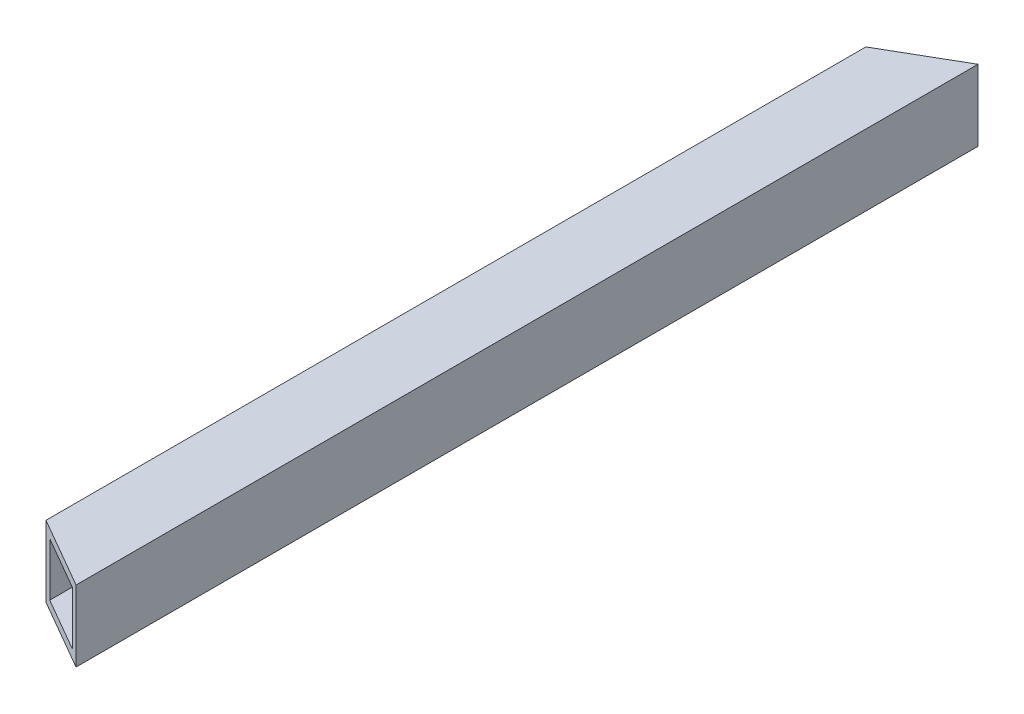
ISO-10303-21;
HEADER;
FILE_DESCRIPTION(('STEP AP214'),'2;1');
FILE_NAME('part.step','',(''),(''),'','','');
FILE_SCHEMA(('AUTOMOTIVE_DESIGN { 1 0 10303 214 1 1 1 1 }'));
ENDSEC;
DATA;
#1=APPLICATION_CONTEXT('core data for automotive mechanical design processes');
#2=APPLICATION_PROTOCOL_DEFINITION('international standard','automotive_design',2000,#1);
#3=PRODUCT_CONTEXT('',#1,'mechanical');
#4=PRODUCT('Part','Part','',(#3));
#5=PRODUCT_RELATED_PRODUCT_CATEGORY('part','',(#4));
#6=PRODUCT_DEFINITION_FORMATION('','',#4);
#7=PRODUCT_DEFINITION_CONTEXT('part definition',#1,'design');
#8=PRODUCT_DEFINITION('design','',#6,#7);
#9=PRODUCT_DEFINITION_SHAPE('','',#8);
#10=(LENGTH_UNIT() NAMED_UNIT(*) SI_UNIT(.MILLI.,.METRE.));
#11=(NAMED_UNIT(*) PLANE_ANGLE_UNIT() SI_UNIT($,.RADIAN.));
#12=(NAMED_UNIT(*) SI_UNIT($,.STERADIAN.) SOLID_ANGLE_UNIT());
#13=UNCERTAINTY_MEASURE_WITH_UNIT(LENGTH_MEASURE(1.E-05),#10,'distance_accuracy_value','');
#14=(GEOMETRIC_REPRESENTATION_CONTEXT(3) GLOBAL_UNCERTAINTY_ASSIGNED_CONTEXT((#13)) GLOBAL_UNIT_ASSIGNED_CONTEXT((#10,
#11,#12)) REPRESENTATION_CONTEXT('',''));
#15=CARTESIAN_POINT('',(0.,0.,0.));
#16=DIRECTION('',(0.,0.,1.));
#17=DIRECTION('',(1.,0.,0.));
#18=AXIS2_PLACEMENT_3D('',#15,#16,#17);
#19=CARTESIAN_POINT('',(-12.7,12.7,-146.466553162583));
#20=DIRECTION('',(0.500000000000001,0.,0.866025403784438));
#21=DIRECTION('',(0.866025403784438,0.,-0.500000000000001));
#22=AXIS2_PLACEMENT_3D('',#19,#20,#21);
#23=PLANE('',#22);
#24=DIRECTION('',(0.866025403784438,0.,-0.500000000000001));
#25=VECTOR('',#24,1.);
#26=CARTESIAN_POINT('',(-34.8859389608854,-12.7,-133.657495331292));
#27=LINE('',#26,#25);
#28=CARTESIAN_POINT('',(-12.7,-12.7,-146.466553162583));
#29=VERTEX_POINT('',#28);
#30=CARTESIAN_POINT('',(12.7,-12.7,-161.13125));
#31=VERTEX_POINT('',#30);
#32=EDGE_CURVE('E35',#29,#31,#27,.T.);
#33=ORIENTED_EDGE('',*,*,#32,.F.);
#34=DIRECTION('',(0.,-1.,0.));
#35=VECTOR('',#34,1.);
#36=CARTESIAN_POINT('',(-12.7,0.,-146.466553162583));
#37=LINE('',#36,#35);
#38=CARTESIAN_POINT('',(-12.7,12.7,-146.466553162583));
#39=VERTEX_POINT('',#38);
#40=EDGE_CURVE('E104',#39,#29,#37,.T.);
#41=ORIENTED_EDGE('',*,*,#40,.F.);
#42=DIRECTION('',(-0.866025403784438,0.,0.500000000000001));
#43=VECTOR('',#42,1.);
#44=CARTESIAN_POINT('',(-44.4109389608854,12.7,-128.158234017261));
#45=LINE('',#44,#43);
#46=CARTESIAN_POINT('',(12.7,12.7,-161.13125));
#47=VERTEX_POINT('',#46);
#48=EDGE_CURVE('E10',#47,#39,#45,.T.);
#49=ORIENTED_EDGE('',*,*,#48,.F.);
#50=DIRECTION('',(0.,1.,0.));
#51=VECTOR('',#50,1.);
#52=CARTESIAN_POINT('',(12.7,12.7,-161.13125));
#53=LINE('',#52,#51);
#54=EDGE_CURVE('E114',#31,#47,#53,.T.);
#55=ORIENTED_EDGE('',*,*,#54,.F.);
#56=EDGE_LOOP('',(#33,#41,#49,#55));
#57=FACE_BOUND('',#56,.T.);
#58=DIRECTION('',(0.,1.,0.));
#59=VECTOR('',#58,1.);
#60=CARTESIAN_POINT('',(-9.525,1.5875,-148.299640267261));
#61=LINE('',#60,#59);
#62=CARTESIAN_POINT('',(-9.525,-9.525,-148.299640267261));
#63=VERTEX_POINT('',#62);
#64=CARTESIAN_POINT('',(-9.525,9.525,-148.299640267261));
#65=VERTEX_POINT('',#64);
#66=EDGE_CURVE('E108',#63,#65,#61,.T.);
#67=ORIENTED_EDGE('',*,*,#66,.F.);
#68=DIRECTION('',(-0.866025403784438,0.,0.500000000000001));
#69=VECTOR('',#68,1.);
#70=CARTESIAN_POINT('',(-36.0765639608854,-9.525,-132.970087667038));
#71=LINE('',#70,#69);
#72=CARTESIAN_POINT('',(9.525,-9.525,-159.298162895323));
#73=VERTEX_POINT('',#72);
#74=EDGE_CURVE('E145',#73,#63,#71,.T.);
#75=ORIENTED_EDGE('',*,*,#74,.F.);
#76=DIRECTION('',(0.,-1.,0.));
#77=VECTOR('',#76,1.);
#78=CARTESIAN_POINT('',(9.52500000000001,11.1125,-159.298162895323));
#79=LINE('',#78,#77);
#80=CARTESIAN_POINT('',(9.525,9.525,-159.298162895323));
#81=VERTEX_POINT('',#80);
#82=EDGE_CURVE('E130',#81,#73,#79,.T.);
#83=ORIENTED_EDGE('',*,*,#82,.F.);
#84=DIRECTION('',(0.866025403784438,0.,-0.500000000000001));
#85=VECTOR('',#84,1.);
#86=CARTESIAN_POINT('',(-43.2203139608854,9.525,-128.845641681514));
#87=LINE('',#86,#85);
#88=EDGE_CURVE('E93',#65,#81,#87,.T.);
#89=ORIENTED_EDGE('',*,*,#88,.F.);
#90=EDGE_LOOP('',(#67,#75,#83,#89));
#91=FACE_BOUND('',#90,.T.);
#92=ADVANCED_FACE('F16',(#57,#91),#23,.F.);
#93=CARTESIAN_POINT('',(-12.7,12.7,0.));
#94=DIRECTION('',(0.,1.,0.));
#95=DIRECTION('',(0.,0.,1.));
#96=AXIS2_PLACEMENT_3D('',#93,#94,#95);
#97=PLANE('',#96);
#98=ORIENTED_EDGE('',*,*,#48,.T.);
#99=DIRECTION('',(0.,0.,1.));
#100=VECTOR('',#99,1.);
#101=CARTESIAN_POINT('',(-12.7,12.7,0.));
#102=LINE('',#101,#100);
#103=CARTESIAN_POINT('',(-12.7,12.7,146.466553162584));
#104=VERTEX_POINT('',#103);
#105=EDGE_CURVE('E26',#39,#104,#102,.T.);
#106=ORIENTED_EDGE('',*,*,#105,.T.);
#107=DIRECTION('',(0.866025403784439,0.,0.499999999999999));
#108=VECTOR('',#107,1.);
#109=CARTESIAN_POINT('',(-31.7109389608853,12.7,135.490582435969));
#110=LINE('',#109,#108);
#111=CARTESIAN_POINT('',(12.7,12.7,161.13125));
#112=VERTEX_POINT('',#111);
#113=EDGE_CURVE('E134',#104,#112,#110,.T.);
#114=ORIENTED_EDGE('',*,*,#113,.T.);
#115=DIRECTION('',(0.,0.,-1.));
#116=VECTOR('',#115,1.);
#117=CARTESIAN_POINT('',(12.7,12.7,0.));
#118=LINE('',#117,#116);
#119=EDGE_CURVE('E137',#112,#47,#118,.T.);
#120=ORIENTED_EDGE('',*,*,#119,.T.);
#121=EDGE_LOOP('',(#98,#106,#114,#120));
#122=FACE_BOUND('',#121,.T.);
#123=ADVANCED_FACE('F156',(#122),#97,.T.);
#124=CARTESIAN_POINT('',(9.525,9.525,0.));
#125=DIRECTION('',(1.,0.,0.));
#126=DIRECTION('',(0.,0.,-1.));
#127=AXIS2_PLACEMENT_3D('',#124,#125,#126);
#128=PLANE('',#127);
#129=ORIENTED_EDGE('',*,*,#82,.T.);
#130=DIRECTION('',(0.,0.,1.));
#131=VECTOR('',#130,1.);
#132=CARTESIAN_POINT('',(9.525,-9.525,0.));
#133=LINE('',#132,#131);
#134=CARTESIAN_POINT('',(9.525,-9.525,159.298162895323));
#135=VERTEX_POINT('',#134);
#136=EDGE_CURVE('E140',#73,#135,#133,.T.);
#137=ORIENTED_EDGE('',*,*,#136,.T.);
#138=DIRECTION('',(0.,1.,0.));
#139=VECTOR('',#138,1.);
#140=CARTESIAN_POINT('',(9.525,11.1125,159.298162895323));
#141=LINE('',#140,#139);
#142=CARTESIAN_POINT('',(9.525,9.525,159.298162895323));
#143=VERTEX_POINT('',#142);
#144=EDGE_CURVE('E143',#135,#143,#141,.T.);
#145=ORIENTED_EDGE('',*,*,#144,.T.);
#146=DIRECTION('',(0.,0.,-1.));
#147=VECTOR('',#146,1.);
#148=CARTESIAN_POINT('',(9.525,9.525,0.));
#149=LINE('',#148,#147);
#150=EDGE_CURVE('E90',#143,#81,#149,.T.);
#151=ORIENTED_EDGE('',*,*,#150,.T.);
#152=EDGE_LOOP('',(#129,#137,#145,#151));
#153=FACE_BOUND('',#152,.T.);
#154=ADVANCED_FACE('F153',(#153),#128,.F.);
#155=CARTESIAN_POINT('',(9.525,-9.525,0.));
#156=DIRECTION('',(0.,-1.,0.));
#157=DIRECTION('',(0.,0.,-1.));
#158=AXIS2_PLACEMENT_3D('',#155,#156,#157);
#159=PLANE('',#158);
#160=ORIENTED_EDGE('',*,*,#74,.T.);
#161=DIRECTION('',(0.,0.,1.));
#162=VECTOR('',#161,1.);
#163=CARTESIAN_POINT('',(-9.525,-9.525,0.));
#164=LINE('',#163,#162);
#165=CARTESIAN_POINT('',(-9.525,-9.525,148.299640267261));
#166=VERTEX_POINT('',#165);
#167=EDGE_CURVE('E146',#63,#166,#164,.T.);
#168=ORIENTED_EDGE('',*,*,#167,.T.);
#169=DIRECTION('',(0.866025403784439,0.,0.499999999999999));
#170=VECTOR('',#169,1.);
#171=CARTESIAN_POINT('',(-23.3765639608853,-9.525,140.302436085746));
#172=LINE('',#171,#170);
#173=EDGE_CURVE('E100',#166,#135,#172,.T.);
#174=ORIENTED_EDGE('',*,*,#173,.T.);
#175=ORIENTED_EDGE('',*,*,#136,.F.);
#176=EDGE_LOOP('',(#160,#168,#174,#175));
#177=FACE_BOUND('',#176,.T.);
#178=ADVANCED_FACE('F150',(#177),#159,.F.);
#179=CARTESIAN_POINT('',(12.7,12.7,161.13125));
#180=DIRECTION('',(0.499999999999999,0.,-0.866025403784439));
#181=DIRECTION('',(-0.866025403784439,0.,-0.499999999999999));
#182=AXIS2_PLACEMENT_3D('',#179,#180,#181);
#183=PLANE('',#182);
#184=DIRECTION('',(-0.866025403784439,0.,-0.499999999999999));
#185=VECTOR('',#184,1.);
#186=CARTESIAN_POINT('',(-22.1859389608853,-12.7,140.98984375));
#187=LINE('',#186,#185);
#188=CARTESIAN_POINT('',(12.7,-12.7,161.13125));
#189=VERTEX_POINT('',#188);
#190=CARTESIAN_POINT('',(-12.7,-12.7,146.466553162584));
#191=VERTEX_POINT('',#190);
#192=EDGE_CURVE('E78',#189,#191,#187,.T.);
#193=ORIENTED_EDGE('',*,*,#192,.F.);
#194=DIRECTION('',(0.,-1.,0.));
#195=VECTOR('',#194,1.);
#196=CARTESIAN_POINT('',(12.7,12.7,161.13125));
#197=LINE('',#196,#195);
#198=EDGE_CURVE('E94',#112,#189,#197,.T.);
#199=ORIENTED_EDGE('',*,*,#198,.F.);
#200=ORIENTED_EDGE('',*,*,#113,.F.);
#201=DIRECTION('',(0.,1.,0.));
#202=VECTOR('',#201,1.);
#203=CARTESIAN_POINT('',(-12.7,0.,146.466553162584));
#204=LINE('',#203,#202);
#205=EDGE_CURVE('E121',#191,#104,#204,.T.);
#206=ORIENTED_EDGE('',*,*,#205,.F.);
#207=EDGE_LOOP('',(#193,#199,#200,#206));
#208=FACE_BOUND('',#207,.T.);
#209=ORIENTED_EDGE('',*,*,#144,.F.);
#210=ORIENTED_EDGE('',*,*,#173,.F.);
#211=DIRECTION('',(0.,-1.,0.));
#212=VECTOR('',#211,1.);
#213=CARTESIAN_POINT('',(-9.52500000000001,1.5875,148.299640267261));
#214=LINE('',#213,#212);
#215=CARTESIAN_POINT('',(-9.525,9.525,148.299640267261));
#216=VERTEX_POINT('',#215);
#217=EDGE_CURVE('E97',#216,#166,#214,.T.);
#218=ORIENTED_EDGE('',*,*,#217,.F.);
#219=DIRECTION('',(-0.866025403784439,0.,-0.499999999999999));
#220=VECTOR('',#219,1.);
#221=CARTESIAN_POINT('',(-30.5203139608853,9.525,136.177990100223));
#222=LINE('',#221,#220);
#223=EDGE_CURVE('E84',#143,#216,#222,.T.);
#224=ORIENTED_EDGE('',*,*,#223,.F.);
#225=EDGE_LOOP('',(#209,#210,#218,#224));
#226=FACE_BOUND('',#225,.T.);
#227=ADVANCED_FACE('F98',(#208,#226),#183,.F.);
#228=CARTESIAN_POINT('',(-9.525,-9.525,0.));
#229=DIRECTION('',(-1.,0.,0.));
#230=DIRECTION('',(0.,0.,1.));
#231=AXIS2_PLACEMENT_3D('',#228,#229,#230);
#232=PLANE('',#231);
#233=ORIENTED_EDGE('',*,*,#66,.T.);
#234=DIRECTION('',(0.,0.,1.));
#235=VECTOR('',#234,1.);
#236=CARTESIAN_POINT('',(-9.525,9.525,0.));
#237=LINE('',#236,#235);
#238=EDGE_CURVE('E88',#65,#216,#237,.T.);
#239=ORIENTED_EDGE('',*,*,#238,.T.);
#240=ORIENTED_EDGE('',*,*,#217,.T.);
#241=ORIENTED_EDGE('',*,*,#167,.F.);
#242=EDGE_LOOP('',(#233,#239,#240,#241));
#243=FACE_BOUND('',#242,.T.);
#244=ADVANCED_FACE('F107',(#243),#232,.F.);
#245=CARTESIAN_POINT('',(-12.7,-12.7,0.));
#246=DIRECTION('',(-1.,0.,0.));
#247=DIRECTION('',(0.,0.,1.));
#248=AXIS2_PLACEMENT_3D('',#245,#246,#247);
#249=PLANE('',#248);
#250=ORIENTED_EDGE('',*,*,#40,.T.);
#251=DIRECTION('',(0.,0.,-1.));
#252=VECTOR('',#251,1.);
#253=CARTESIAN_POINT('',(-12.7,-12.7,0.));
#254=LINE('',#253,#252);
#255=EDGE_CURVE('E111',#191,#29,#254,.T.);
#256=ORIENTED_EDGE('',*,*,#255,.F.);
#257=ORIENTED_EDGE('',*,*,#205,.T.);
#258=ORIENTED_EDGE('',*,*,#105,.F.);
#259=EDGE_LOOP('',(#250,#256,#257,#258));
#260=FACE_BOUND('',#259,.T.);
#261=ADVANCED_FACE('F174',(#260),#249,.T.);
#262=CARTESIAN_POINT('',(-9.525,9.525,0.));
#263=DIRECTION('',(0.,1.,0.));
#264=DIRECTION('',(0.,0.,1.));
#265=AXIS2_PLACEMENT_3D('',#262,#263,#264);
#266=PLANE('',#265);
#267=ORIENTED_EDGE('',*,*,#88,.T.);
#268=ORIENTED_EDGE('',*,*,#150,.F.);
#269=ORIENTED_EDGE('',*,*,#223,.T.);
#270=ORIENTED_EDGE('',*,*,#238,.F.);
#271=EDGE_LOOP('',(#267,#268,#269,#270));
#272=FACE_BOUND('',#271,.T.);
#273=ADVANCED_FACE('F86',(#272),#266,.F.);
#274=CARTESIAN_POINT('',(12.7,12.7,0.));
#275=DIRECTION('',(1.,0.,0.));
#276=DIRECTION('',(0.,0.,-1.));
#277=AXIS2_PLACEMENT_3D('',#274,#275,#276);
#278=PLANE('',#277);
#279=ORIENTED_EDGE('',*,*,#198,.T.);
#280=DIRECTION('',(0.,0.,-1.));
#281=VECTOR('',#280,1.);
#282=CARTESIAN_POINT('',(12.7,-12.7,0.));
#283=LINE('',#282,#281);
#284=EDGE_CURVE('E20',#189,#31,#283,.T.);
#285=ORIENTED_EDGE('',*,*,#284,.T.);
#286=ORIENTED_EDGE('',*,*,#54,.T.);
#287=ORIENTED_EDGE('',*,*,#119,.F.);
#288=EDGE_LOOP('',(#279,#285,#286,#287));
#289=FACE_BOUND('',#288,.T.);
#290=ADVANCED_FACE('F178',(#289),#278,.T.);
#291=CARTESIAN_POINT('',(12.7,-12.7,0.));
#292=DIRECTION('',(0.,-1.,0.));
#293=DIRECTION('',(0.,0.,-1.));
#294=AXIS2_PLACEMENT_3D('',#291,#292,#293);
#295=PLANE('',#294);
#296=ORIENTED_EDGE('',*,*,#32,.T.);
#297=ORIENTED_EDGE('',*,*,#284,.F.);
#298=ORIENTED_EDGE('',*,*,#192,.T.);
#299=ORIENTED_EDGE('',*,*,#255,.T.);
#300=EDGE_LOOP('',(#296,#297,#298,#299));
#301=FACE_BOUND('',#300,.T.);
#302=ADVANCED_FACE('F18',(#301),#295,.T.);
#303=CLOSED_SHELL('',(#92,#123,#154,#178,#227,#244,#261,#273,#290,#302));
#304=MANIFOLD_SOLID_BREP('B1',#303);
#305=ADVANCED_BREP_SHAPE_REPRESENTATION('',(#18,#304),#14);
#306=SHAPE_DEFINITION_REPRESENTATION(#9,#305);
ENDSEC;
END-ISO-10303-21;
